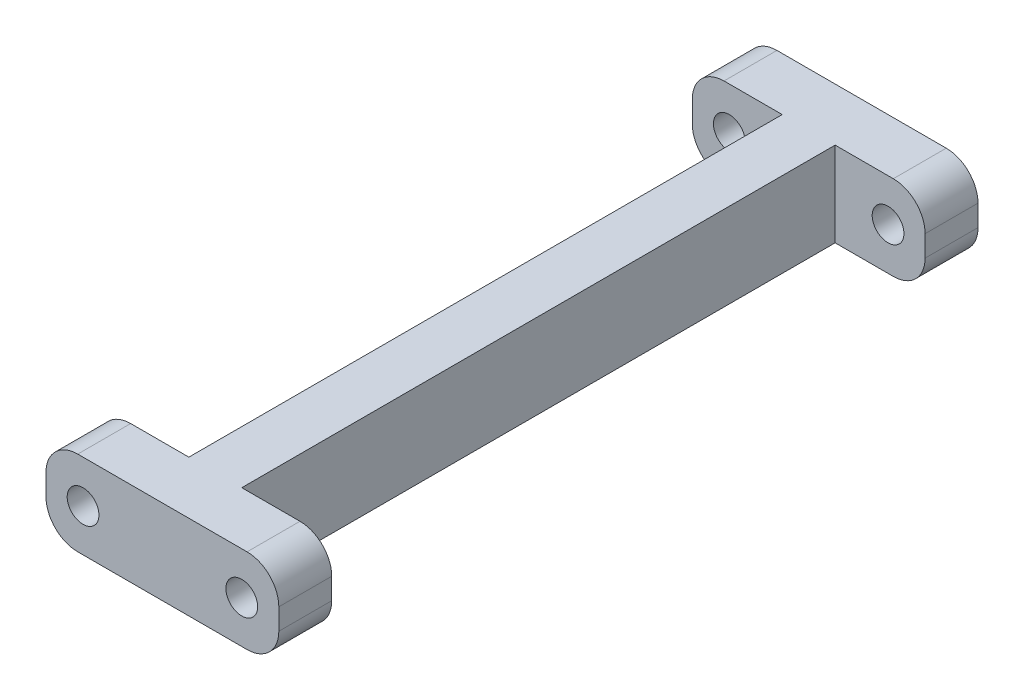
ISO-10303-21;
HEADER;
FILE_DESCRIPTION(('STEP AP214'),'2;1');
FILE_NAME('part.step','',(''),(''),'','','');
FILE_SCHEMA(('AUTOMOTIVE_DESIGN { 1 0 10303 214 1 1 1 1 }'));
ENDSEC;
DATA;
#1=APPLICATION_CONTEXT('core data for automotive mechanical design processes');
#2=APPLICATION_PROTOCOL_DEFINITION('international standard','automotive_design',2000,#1);
#3=PRODUCT_CONTEXT('',#1,'mechanical');
#4=PRODUCT('Part','Part','',(#3));
#5=PRODUCT_RELATED_PRODUCT_CATEGORY('part','',(#4));
#6=PRODUCT_DEFINITION_FORMATION('','',#4);
#7=PRODUCT_DEFINITION_CONTEXT('part definition',#1,'design');
#8=PRODUCT_DEFINITION('design','',#6,#7);
#9=PRODUCT_DEFINITION_SHAPE('','',#8);
#10=(LENGTH_UNIT() NAMED_UNIT(*) SI_UNIT(.MILLI.,.METRE.));
#11=(NAMED_UNIT(*) PLANE_ANGLE_UNIT() SI_UNIT($,.RADIAN.));
#12=(NAMED_UNIT(*) SI_UNIT($,.STERADIAN.) SOLID_ANGLE_UNIT());
#13=UNCERTAINTY_MEASURE_WITH_UNIT(LENGTH_MEASURE(1.E-05),#10,'distance_accuracy_value','');
#14=(GEOMETRIC_REPRESENTATION_CONTEXT(3) GLOBAL_UNCERTAINTY_ASSIGNED_CONTEXT((#13)) GLOBAL_UNIT_ASSIGNED_CONTEXT((#10,
#11,#12)) REPRESENTATION_CONTEXT('',''));
#15=CARTESIAN_POINT('',(0.,0.,0.));
#16=DIRECTION('',(0.,0.,1.));
#17=DIRECTION('',(1.,0.,0.));
#18=AXIS2_PLACEMENT_3D('',#15,#16,#17);
#19=CARTESIAN_POINT('',(8.5,8.,66.0706));
#20=DIRECTION('',(1.,0.,0.));
#21=DIRECTION('',(0.,1.,0.));
#22=AXIS2_PLACEMENT_3D('',#19,#20,#21);
#23=PLANE('',#22);
#24=DIRECTION('',(0.,-1.,0.));
#25=VECTOR('',#24,1.);
#26=CARTESIAN_POINT('',(8.5,8.,61.0706));
#27=LINE('',#26,#25);
#28=CARTESIAN_POINT('',(8.5,8.,61.0706));
#29=VERTEX_POINT('',#28);
#30=CARTESIAN_POINT('',(8.5,0.,61.0706));
#31=VERTEX_POINT('',#30);
#32=EDGE_CURVE('E335',#29,#31,#27,.T.);
#33=ORIENTED_EDGE('',*,*,#32,.F.);
#34=DIRECTION('',(0.,0.,-1.));
#35=VECTOR('',#34,1.);
#36=CARTESIAN_POINT('',(8.5,8.,66.0706));
#37=LINE('',#36,#35);
#38=CARTESIAN_POINT('',(8.5,8.,5.));
#39=VERTEX_POINT('',#38);
#40=EDGE_CURVE('E200',#29,#39,#37,.T.);
#41=ORIENTED_EDGE('',*,*,#40,.T.);
#42=DIRECTION('',(0.,-1.,0.));
#43=VECTOR('',#42,1.);
#44=CARTESIAN_POINT('',(8.5,8.,5.));
#45=LINE('',#44,#43);
#46=CARTESIAN_POINT('',(8.5,0.,5.));
#47=VERTEX_POINT('',#46);
#48=EDGE_CURVE('E337',#39,#47,#45,.T.);
#49=ORIENTED_EDGE('',*,*,#48,.T.);
#50=DIRECTION('',(0.,0.,-1.));
#51=VECTOR('',#50,1.);
#52=CARTESIAN_POINT('',(8.5,0.,66.0706));
#53=LINE('',#52,#51);
#54=EDGE_CURVE('E202',#31,#47,#53,.T.);
#55=ORIENTED_EDGE('',*,*,#54,.F.);
#56=EDGE_LOOP('',(#33,#41,#49,#55));
#57=FACE_BOUND('',#56,.T.);
#58=ADVANCED_FACE('F33',(#57),#23,.F.);
#59=CARTESIAN_POINT('',(13.5,8.,66.0706));
#60=DIRECTION('',(-1.,0.,0.));
#61=DIRECTION('',(0.,0.,1.));
#62=AXIS2_PLACEMENT_3D('',#59,#60,#61);
#63=PLANE('',#62);
#64=DIRECTION('',(0.,1.,0.));
#65=VECTOR('',#64,1.);
#66=CARTESIAN_POINT('',(13.5,8.,61.0706));
#67=LINE('',#66,#65);
#68=CARTESIAN_POINT('',(13.5,0.,61.0706));
#69=VERTEX_POINT('',#68);
#70=CARTESIAN_POINT('',(13.5,8.,61.0706));
#71=VERTEX_POINT('',#70);
#72=EDGE_CURVE('E187',#69,#71,#67,.T.);
#73=ORIENTED_EDGE('',*,*,#72,.F.);
#74=DIRECTION('',(0.,0.,-1.));
#75=VECTOR('',#74,1.);
#76=CARTESIAN_POINT('',(13.5,0.,66.0706));
#77=LINE('',#76,#75);
#78=CARTESIAN_POINT('',(13.5,0.,5.));
#79=VERTEX_POINT('',#78);
#80=EDGE_CURVE('E199',#69,#79,#77,.T.);
#81=ORIENTED_EDGE('',*,*,#80,.T.);
#82=DIRECTION('',(0.,1.,0.));
#83=VECTOR('',#82,1.);
#84=CARTESIAN_POINT('',(13.5,8.,5.));
#85=LINE('',#84,#83);
#86=CARTESIAN_POINT('',(13.5,8.,5.));
#87=VERTEX_POINT('',#86);
#88=EDGE_CURVE('E198',#79,#87,#85,.T.);
#89=ORIENTED_EDGE('',*,*,#88,.T.);
#90=DIRECTION('',(0.,0.,-1.));
#91=VECTOR('',#90,1.);
#92=CARTESIAN_POINT('',(13.5,8.,66.0706));
#93=LINE('',#92,#91);
#94=EDGE_CURVE('E176',#71,#87,#93,.T.);
#95=ORIENTED_EDGE('',*,*,#94,.F.);
#96=EDGE_LOOP('',(#73,#81,#89,#95));
#97=FACE_BOUND('',#96,.T.);
#98=ADVANCED_FACE('F196',(#97),#63,.F.);
#99=CARTESIAN_POINT('',(0.,0.,5.));
#100=DIRECTION('',(0.,0.,-1.));
#101=DIRECTION('',(-1.,0.,0.));
#102=AXIS2_PLACEMENT_3D('',#99,#100,#101);
#103=PLANE('',#102);
#104=CARTESIAN_POINT('',(3.5,4.,5.));
#105=DIRECTION('',(0.,0.,1.));
#106=DIRECTION('',(1.,0.,0.));
#107=AXIS2_PLACEMENT_3D('',#104,#105,#106);
#108=CIRCLE('',#107,1.5);
#109=CARTESIAN_POINT('',(5.,4.,5.));
#110=VERTEX_POINT('',#109);
#111=EDGE_CURVE('E217',#110,#110,#108,.T.);
#112=ORIENTED_EDGE('',*,*,#111,.F.);
#113=EDGE_LOOP('',(#112));
#114=FACE_BOUND('',#113,.T.);
#115=DIRECTION('',(0.,-1.,0.));
#116=VECTOR('',#115,1.);
#117=CARTESIAN_POINT('',(0.,0.,5.));
#118=LINE('',#117,#116);
#119=CARTESIAN_POINT('',(0.,5.,5.));
#120=VERTEX_POINT('',#119);
#121=CARTESIAN_POINT('',(0.,3.,5.));
#122=VERTEX_POINT('',#121);
#123=EDGE_CURVE('E223',#120,#122,#118,.T.);
#124=ORIENTED_EDGE('',*,*,#123,.T.);
#125=CARTESIAN_POINT('',(3.,3.,5.));
#126=DIRECTION('',(0.,0.,-1.));
#127=DIRECTION('',(-1.,0.,0.));
#128=AXIS2_PLACEMENT_3D('',#125,#126,#127);
#129=CIRCLE('',#128,3.);
#130=CARTESIAN_POINT('',(3.,0.,5.));
#131=VERTEX_POINT('',#130);
#132=EDGE_CURVE('E268',#122,#131,#129,.F.);
#133=ORIENTED_EDGE('',*,*,#132,.T.);
#134=DIRECTION('',(1.,0.,0.));
#135=VECTOR('',#134,1.);
#136=CARTESIAN_POINT('',(0.,0.,5.));
#137=LINE('',#136,#135);
#138=EDGE_CURVE('E228',#131,#47,#137,.T.);
#139=ORIENTED_EDGE('',*,*,#138,.T.);
#140=ORIENTED_EDGE('',*,*,#48,.F.);
#141=DIRECTION('',(-1.,0.,0.));
#142=VECTOR('',#141,1.);
#143=CARTESIAN_POINT('',(0.,8.,5.));
#144=LINE('',#143,#142);
#145=CARTESIAN_POINT('',(3.,8.,5.));
#146=VERTEX_POINT('',#145);
#147=EDGE_CURVE('E233',#39,#146,#144,.T.);
#148=ORIENTED_EDGE('',*,*,#147,.T.);
#149=CARTESIAN_POINT('',(3.,5.,5.));
#150=DIRECTION('',(0.,0.,-1.));
#151=DIRECTION('',(-1.,0.,0.));
#152=AXIS2_PLACEMENT_3D('',#149,#150,#151);
#153=CIRCLE('',#152,3.);
#154=EDGE_CURVE('E266',#146,#120,#153,.F.);
#155=ORIENTED_EDGE('',*,*,#154,.T.);
#156=EDGE_LOOP('',(#124,#133,#139,#140,#148,#155));
#157=FACE_BOUND('',#156,.T.);
#158=ADVANCED_FACE('F348',(#114,#157),#103,.F.);
#159=CARTESIAN_POINT('',(18.5,4.,5.));
#160=DIRECTION('',(0.,0.,1.));
#161=DIRECTION('',(1.,0.,0.));
#162=AXIS2_PLACEMENT_3D('',#159,#160,#161);
#163=CIRCLE('',#162,1.49999999999999);
#164=CARTESIAN_POINT('',(20.,4.,5.));
#165=VERTEX_POINT('',#164);
#166=EDGE_CURVE('E211',#165,#165,#163,.T.);
#167=ORIENTED_EDGE('',*,*,#166,.F.);
#168=EDGE_LOOP('',(#167));
#169=FACE_BOUND('',#168,.T.);
#170=CARTESIAN_POINT('',(19.,0.,5.));
#171=VERTEX_POINT('',#170);
#172=EDGE_CURVE('E226',#79,#171,#137,.T.);
#173=ORIENTED_EDGE('',*,*,#172,.T.);
#174=CARTESIAN_POINT('',(19.,3.,5.));
#175=DIRECTION('',(0.,0.,-1.));
#176=DIRECTION('',(-1.,0.,0.));
#177=AXIS2_PLACEMENT_3D('',#174,#175,#176);
#178=CIRCLE('',#177,3.);
#179=CARTESIAN_POINT('',(22.,3.,5.));
#180=VERTEX_POINT('',#179);
#181=EDGE_CURVE('E286',#171,#180,#178,.F.);
#182=ORIENTED_EDGE('',*,*,#181,.T.);
#183=DIRECTION('',(0.,1.,0.));
#184=VECTOR('',#183,1.);
#185=CARTESIAN_POINT('',(22.,0.,5.));
#186=LINE('',#185,#184);
#187=CARTESIAN_POINT('',(22.,5.,5.));
#188=VERTEX_POINT('',#187);
#189=EDGE_CURVE('E230',#180,#188,#186,.T.);
#190=ORIENTED_EDGE('',*,*,#189,.T.);
#191=CARTESIAN_POINT('',(19.,5.,5.));
#192=DIRECTION('',(0.,0.,-1.));
#193=DIRECTION('',(-1.,0.,0.));
#194=AXIS2_PLACEMENT_3D('',#191,#192,#193);
#195=CIRCLE('',#194,3.);
#196=CARTESIAN_POINT('',(19.,8.,5.));
#197=VERTEX_POINT('',#196);
#198=EDGE_CURVE('E284',#188,#197,#195,.F.);
#199=ORIENTED_EDGE('',*,*,#198,.T.);
#200=EDGE_CURVE('E194',#197,#87,#144,.T.);
#201=ORIENTED_EDGE('',*,*,#200,.T.);
#202=ORIENTED_EDGE('',*,*,#88,.F.);
#203=EDGE_LOOP('',(#173,#182,#190,#199,#201,#202));
#204=FACE_BOUND('',#203,.T.);
#205=ADVANCED_FACE('F418',(#169,#204),#103,.F.);
#206=CARTESIAN_POINT('',(0.,0.,0.));
#207=DIRECTION('',(0.,0.,-1.));
#208=DIRECTION('',(-1.,0.,0.));
#209=AXIS2_PLACEMENT_3D('',#206,#207,#208);
#210=PLANE('',#209);
#211=CARTESIAN_POINT('',(3.5,4.,0.));
#212=DIRECTION('',(0.,0.,1.));
#213=DIRECTION('',(1.,0.,0.));
#214=AXIS2_PLACEMENT_3D('',#211,#212,#213);
#215=CIRCLE('',#214,1.5);
#216=CARTESIAN_POINT('',(5.,4.,0.));
#217=VERTEX_POINT('',#216);
#218=EDGE_CURVE('E214',#217,#217,#215,.T.);
#219=ORIENTED_EDGE('',*,*,#218,.T.);
#220=EDGE_LOOP('',(#219));
#221=FACE_BOUND('',#220,.T.);
#222=DIRECTION('',(1.,0.,0.));
#223=VECTOR('',#222,1.);
#224=CARTESIAN_POINT('',(0.,0.,0.));
#225=LINE('',#224,#223);
#226=CARTESIAN_POINT('',(3.,0.,0.));
#227=VERTEX_POINT('',#226);
#228=CARTESIAN_POINT('',(19.,0.,0.));
#229=VERTEX_POINT('',#228);
#230=EDGE_CURVE('E237',#227,#229,#225,.T.);
#231=ORIENTED_EDGE('',*,*,#230,.F.);
#232=CARTESIAN_POINT('',(3.,3.,0.));
#233=DIRECTION('',(0.,0.,-1.));
#234=DIRECTION('',(-1.,0.,0.));
#235=AXIS2_PLACEMENT_3D('',#232,#233,#234);
#236=CIRCLE('',#235,3.);
#237=CARTESIAN_POINT('',(0.,3.,0.));
#238=VERTEX_POINT('',#237);
#239=EDGE_CURVE('E259',#227,#238,#236,.T.);
#240=ORIENTED_EDGE('',*,*,#239,.T.);
#241=DIRECTION('',(0.,-1.,0.));
#242=VECTOR('',#241,1.);
#243=CARTESIAN_POINT('',(0.,0.,0.));
#244=LINE('',#243,#242);
#245=CARTESIAN_POINT('',(0.,5.,0.));
#246=VERTEX_POINT('',#245);
#247=EDGE_CURVE('E220',#246,#238,#244,.T.);
#248=ORIENTED_EDGE('',*,*,#247,.F.);
#249=CARTESIAN_POINT('',(3.,5.,0.));
#250=DIRECTION('',(0.,0.,-1.));
#251=DIRECTION('',(-1.,0.,0.));
#252=AXIS2_PLACEMENT_3D('',#249,#250,#251);
#253=CIRCLE('',#252,3.);
#254=CARTESIAN_POINT('',(3.,8.,0.));
#255=VERTEX_POINT('',#254);
#256=EDGE_CURVE('E257',#246,#255,#253,.T.);
#257=ORIENTED_EDGE('',*,*,#256,.T.);
#258=DIRECTION('',(-1.,0.,0.));
#259=VECTOR('',#258,1.);
#260=CARTESIAN_POINT('',(0.,8.,0.));
#261=LINE('',#260,#259);
#262=CARTESIAN_POINT('',(19.,8.,0.));
#263=VERTEX_POINT('',#262);
#264=EDGE_CURVE('E227',#263,#255,#261,.T.);
#265=ORIENTED_EDGE('',*,*,#264,.F.);
#266=CARTESIAN_POINT('',(19.,5.,0.));
#267=DIRECTION('',(0.,0.,-1.));
#268=DIRECTION('',(-1.,0.,0.));
#269=AXIS2_PLACEMENT_3D('',#266,#267,#268);
#270=CIRCLE('',#269,3.);
#271=CARTESIAN_POINT('',(22.,5.,0.));
#272=VERTEX_POINT('',#271);
#273=EDGE_CURVE('E253',#263,#272,#270,.T.);
#274=ORIENTED_EDGE('',*,*,#273,.T.);
#275=DIRECTION('',(0.,1.,0.));
#276=VECTOR('',#275,1.);
#277=CARTESIAN_POINT('',(22.,0.,0.));
#278=LINE('',#277,#276);
#279=CARTESIAN_POINT('',(22.,3.,0.));
#280=VERTEX_POINT('',#279);
#281=EDGE_CURVE('E240',#280,#272,#278,.T.);
#282=ORIENTED_EDGE('',*,*,#281,.F.);
#283=CARTESIAN_POINT('',(19.,3.,0.));
#284=DIRECTION('',(0.,0.,-1.));
#285=DIRECTION('',(-1.,0.,0.));
#286=AXIS2_PLACEMENT_3D('',#283,#284,#285);
#287=CIRCLE('',#286,3.);
#288=EDGE_CURVE('E255',#280,#229,#287,.T.);
#289=ORIENTED_EDGE('',*,*,#288,.T.);
#290=EDGE_LOOP('',(#231,#240,#248,#257,#265,#274,#282,#289));
#291=FACE_BOUND('',#290,.T.);
#292=CARTESIAN_POINT('',(18.5,4.,0.));
#293=DIRECTION('',(0.,0.,1.));
#294=DIRECTION('',(1.,0.,0.));
#295=AXIS2_PLACEMENT_3D('',#292,#293,#294);
#296=CIRCLE('',#295,1.49999999999999);
#297=CARTESIAN_POINT('',(20.,4.,0.));
#298=VERTEX_POINT('',#297);
#299=EDGE_CURVE('E210',#298,#298,#296,.T.);
#300=ORIENTED_EDGE('',*,*,#299,.T.);
#301=EDGE_LOOP('',(#300));
#302=FACE_BOUND('',#301,.T.);
#303=ADVANCED_FACE('F420',(#221,#291,#302),#210,.T.);
#304=CARTESIAN_POINT('',(0.,0.,5.));
#305=DIRECTION('',(1.,0.,0.));
#306=DIRECTION('',(0.,0.,-1.));
#307=AXIS2_PLACEMENT_3D('',#304,#305,#306);
#308=PLANE('',#307);
#309=ORIENTED_EDGE('',*,*,#247,.T.);
#310=DIRECTION('',(0.,0.,-1.));
#311=VECTOR('',#310,1.);
#312=CARTESIAN_POINT('',(0.,3.,5.));
#313=LINE('',#312,#311);
#314=EDGE_CURVE('E264',#238,#122,#313,.F.);
#315=ORIENTED_EDGE('',*,*,#314,.T.);
#316=ORIENTED_EDGE('',*,*,#123,.F.);
#317=DIRECTION('',(0.,0.,-1.));
#318=VECTOR('',#317,1.);
#319=CARTESIAN_POINT('',(0.,5.,5.));
#320=LINE('',#319,#318);
#321=EDGE_CURVE('E261',#120,#246,#320,.T.);
#322=ORIENTED_EDGE('',*,*,#321,.T.);
#323=EDGE_LOOP('',(#309,#315,#316,#322));
#324=FACE_BOUND('',#323,.T.);
#325=ADVANCED_FACE('F359',(#324),#308,.F.);
#326=CARTESIAN_POINT('',(0.,0.,5.));
#327=DIRECTION('',(0.,1.,0.));
#328=DIRECTION('',(0.,0.,1.));
#329=AXIS2_PLACEMENT_3D('',#326,#327,#328);
#330=PLANE('',#329);
#331=ORIENTED_EDGE('',*,*,#138,.F.);
#332=DIRECTION('',(0.,0.,-1.));
#333=VECTOR('',#332,1.);
#334=CARTESIAN_POINT('',(3.,0.,5.));
#335=LINE('',#334,#333);
#336=EDGE_CURVE('E250',#131,#227,#335,.T.);
#337=ORIENTED_EDGE('',*,*,#336,.T.);
#338=ORIENTED_EDGE('',*,*,#230,.T.);
#339=DIRECTION('',(0.,0.,-1.));
#340=VECTOR('',#339,1.);
#341=CARTESIAN_POINT('',(19.,0.,5.));
#342=LINE('',#341,#340);
#343=EDGE_CURVE('E248',#229,#171,#342,.F.);
#344=ORIENTED_EDGE('',*,*,#343,.T.);
#345=ORIENTED_EDGE('',*,*,#172,.F.);
#346=ORIENTED_EDGE('',*,*,#80,.F.);
#347=DIRECTION('',(1.,0.,0.));
#348=VECTOR('',#347,1.);
#349=CARTESIAN_POINT('',(0.,0.,61.0706));
#350=LINE('',#349,#348);
#351=CARTESIAN_POINT('',(19.,0.,61.0706));
#352=VERTEX_POINT('',#351);
#353=EDGE_CURVE('E190',#69,#352,#350,.T.);
#354=ORIENTED_EDGE('',*,*,#353,.T.);
#355=DIRECTION('',(0.,0.,1.));
#356=VECTOR('',#355,1.);
#357=CARTESIAN_POINT('',(19.,0.,66.0706));
#358=LINE('',#357,#356);
#359=CARTESIAN_POINT('',(19.,0.,66.0706));
#360=VERTEX_POINT('',#359);
#361=EDGE_CURVE('E245',#352,#360,#358,.T.);
#362=ORIENTED_EDGE('',*,*,#361,.T.);
#363=DIRECTION('',(1.,0.,0.));
#364=VECTOR('',#363,1.);
#365=CARTESIAN_POINT('',(8.5,0.,66.0706));
#366=LINE('',#365,#364);
#367=CARTESIAN_POINT('',(3.,0.,66.0706));
#368=VERTEX_POINT('',#367);
#369=EDGE_CURVE('E338',#368,#360,#366,.T.);
#370=ORIENTED_EDGE('',*,*,#369,.F.);
#371=DIRECTION('',(0.,0.,1.));
#372=VECTOR('',#371,1.);
#373=CARTESIAN_POINT('',(3.,0.,61.0706));
#374=LINE('',#373,#372);
#375=CARTESIAN_POINT('',(3.,0.,61.0706));
#376=VERTEX_POINT('',#375);
#377=EDGE_CURVE('E193',#368,#376,#374,.F.);
#378=ORIENTED_EDGE('',*,*,#377,.T.);
#379=EDGE_CURVE('E329',#376,#31,#350,.T.);
#380=ORIENTED_EDGE('',*,*,#379,.T.);
#381=ORIENTED_EDGE('',*,*,#54,.T.);
#382=EDGE_LOOP('',(#331,#337,#338,#344,#345,#346,#354,#362,#370,#378,#380,#381));
#383=FACE_BOUND('',#382,.T.);
#384=ADVANCED_FACE('F366',(#383),#330,.F.);
#385=CARTESIAN_POINT('',(22.,0.,5.));
#386=DIRECTION('',(-1.,0.,0.));
#387=DIRECTION('',(0.,0.,1.));
#388=AXIS2_PLACEMENT_3D('',#385,#386,#387);
#389=PLANE('',#388);
#390=ORIENTED_EDGE('',*,*,#189,.F.);
#391=DIRECTION('',(0.,0.,-1.));
#392=VECTOR('',#391,1.);
#393=CARTESIAN_POINT('',(22.,3.,5.));
#394=LINE('',#393,#392);
#395=EDGE_CURVE('E281',#180,#280,#394,.T.);
#396=ORIENTED_EDGE('',*,*,#395,.T.);
#397=ORIENTED_EDGE('',*,*,#281,.T.);
#398=DIRECTION('',(0.,0.,-1.));
#399=VECTOR('',#398,1.);
#400=CARTESIAN_POINT('',(22.,5.,5.));
#401=LINE('',#400,#399);
#402=EDGE_CURVE('E279',#272,#188,#401,.F.);
#403=ORIENTED_EDGE('',*,*,#402,.T.);
#404=EDGE_LOOP('',(#390,#396,#397,#403));
#405=FACE_BOUND('',#404,.T.);
#406=ADVANCED_FACE('F426',(#405),#389,.F.);
#407=CARTESIAN_POINT('',(0.,8.,5.));
#408=DIRECTION('',(0.,-1.,0.));
#409=DIRECTION('',(0.,0.,-1.));
#410=AXIS2_PLACEMENT_3D('',#407,#408,#409);
#411=PLANE('',#410);
#412=ORIENTED_EDGE('',*,*,#264,.T.);
#413=DIRECTION('',(0.,0.,-1.));
#414=VECTOR('',#413,1.);
#415=CARTESIAN_POINT('',(3.,8.,5.));
#416=LINE('',#415,#414);
#417=EDGE_CURVE('E277',#255,#146,#416,.F.);
#418=ORIENTED_EDGE('',*,*,#417,.T.);
#419=ORIENTED_EDGE('',*,*,#147,.F.);
#420=ORIENTED_EDGE('',*,*,#40,.F.);
#421=DIRECTION('',(-1.,0.,0.));
#422=VECTOR('',#421,1.);
#423=CARTESIAN_POINT('',(0.,8.,61.0706));
#424=LINE('',#423,#422);
#425=CARTESIAN_POINT('',(3.,8.,61.0706));
#426=VERTEX_POINT('',#425);
#427=EDGE_CURVE('E184',#29,#426,#424,.T.);
#428=ORIENTED_EDGE('',*,*,#427,.T.);
#429=DIRECTION('',(0.,0.,1.));
#430=VECTOR('',#429,1.);
#431=CARTESIAN_POINT('',(3.,8.,66.0706));
#432=LINE('',#431,#430);
#433=CARTESIAN_POINT('',(3.,8.,66.0706));
#434=VERTEX_POINT('',#433);
#435=EDGE_CURVE('E270',#426,#434,#432,.T.);
#436=ORIENTED_EDGE('',*,*,#435,.T.);
#437=DIRECTION('',(-1.,0.,0.));
#438=VECTOR('',#437,1.);
#439=CARTESIAN_POINT('',(8.5,8.,66.0706));
#440=LINE('',#439,#438);
#441=CARTESIAN_POINT('',(19.,8.,66.0706));
#442=VERTEX_POINT('',#441);
#443=EDGE_CURVE('E204',#442,#434,#440,.T.);
#444=ORIENTED_EDGE('',*,*,#443,.F.);
#445=DIRECTION('',(0.,0.,1.));
#446=VECTOR('',#445,1.);
#447=CARTESIAN_POINT('',(19.,8.,61.0706));
#448=LINE('',#447,#446);
#449=CARTESIAN_POINT('',(19.,8.,61.0706));
#450=VERTEX_POINT('',#449);
#451=EDGE_CURVE('E180',#442,#450,#448,.F.);
#452=ORIENTED_EDGE('',*,*,#451,.T.);
#453=EDGE_CURVE('E170',#450,#71,#424,.T.);
#454=ORIENTED_EDGE('',*,*,#453,.T.);
#455=ORIENTED_EDGE('',*,*,#94,.T.);
#456=ORIENTED_EDGE('',*,*,#200,.F.);
#457=DIRECTION('',(0.,0.,-1.));
#458=VECTOR('',#457,1.);
#459=CARTESIAN_POINT('',(19.,8.,5.));
#460=LINE('',#459,#458);
#461=EDGE_CURVE('E274',#197,#263,#460,.T.);
#462=ORIENTED_EDGE('',*,*,#461,.T.);
#463=EDGE_LOOP('',(#412,#418,#419,#420,#428,#436,#444,#452,#454,#455,#456,#462));
#464=FACE_BOUND('',#463,.T.);
#465=ADVANCED_FACE('F173',(#464),#411,.F.);
#466=CARTESIAN_POINT('',(3.5,4.,5.));
#467=DIRECTION('',(0.,0.,-1.));
#468=DIRECTION('',(-1.,0.,0.));
#469=AXIS2_PLACEMENT_3D('',#466,#467,#468);
#470=CYLINDRICAL_SURFACE('',#469,1.5);
#471=ORIENTED_EDGE('',*,*,#111,.T.);
#472=EDGE_LOOP('',(#471));
#473=FACE_BOUND('',#472,.T.);
#474=ORIENTED_EDGE('',*,*,#218,.F.);
#475=EDGE_LOOP('',(#474));
#476=FACE_BOUND('',#475,.T.);
#477=ADVANCED_FACE('F411',(#473,#476),#470,.F.);
#478=CARTESIAN_POINT('',(18.5,4.,5.));
#479=DIRECTION('',(0.,0.,-1.));
#480=DIRECTION('',(-1.,0.,0.));
#481=AXIS2_PLACEMENT_3D('',#478,#479,#480);
#482=CYLINDRICAL_SURFACE('',#481,1.49999999999999);
#483=ORIENTED_EDGE('',*,*,#166,.T.);
#484=EDGE_LOOP('',(#483));
#485=FACE_BOUND('',#484,.T.);
#486=ORIENTED_EDGE('',*,*,#299,.F.);
#487=EDGE_LOOP('',(#486));
#488=FACE_BOUND('',#487,.T.);
#489=ADVANCED_FACE('F408',(#485,#488),#482,.F.);
#490=CARTESIAN_POINT('',(0.,0.,66.0706));
#491=DIRECTION('',(0.,0.,1.));
#492=DIRECTION('',(1.,0.,0.));
#493=AXIS2_PLACEMENT_3D('',#490,#491,#492);
#494=PLANE('',#493);
#495=DIRECTION('',(0.,1.,0.));
#496=VECTOR('',#495,1.);
#497=CARTESIAN_POINT('',(22.,0.,66.0706));
#498=LINE('',#497,#496);
#499=CARTESIAN_POINT('',(22.,3.,66.0706));
#500=VERTEX_POINT('',#499);
#501=CARTESIAN_POINT('',(22.,5.,66.0706));
#502=VERTEX_POINT('',#501);
#503=EDGE_CURVE('E327',#500,#502,#498,.T.);
#504=ORIENTED_EDGE('',*,*,#503,.T.);
#505=CARTESIAN_POINT('',(19.,5.,66.0706));
#506=DIRECTION('',(0.,0.,1.));
#507=DIRECTION('',(1.,0.,0.));
#508=AXIS2_PLACEMENT_3D('',#505,#506,#507);
#509=CIRCLE('',#508,3.);
#510=EDGE_CURVE('E299',#502,#442,#509,.T.);
#511=ORIENTED_EDGE('',*,*,#510,.T.);
#512=ORIENTED_EDGE('',*,*,#443,.T.);
#513=CARTESIAN_POINT('',(3.,5.,66.0706));
#514=DIRECTION('',(0.,0.,1.));
#515=DIRECTION('',(1.,0.,0.));
#516=AXIS2_PLACEMENT_3D('',#513,#514,#515);
#517=CIRCLE('',#516,3.);
#518=CARTESIAN_POINT('',(0.,5.,66.0706));
#519=VERTEX_POINT('',#518);
#520=EDGE_CURVE('E293',#434,#519,#517,.T.);
#521=ORIENTED_EDGE('',*,*,#520,.T.);
#522=DIRECTION('',(0.,-1.,0.));
#523=VECTOR('',#522,1.);
#524=CARTESIAN_POINT('',(0.,0.,66.0706));
#525=LINE('',#524,#523);
#526=CARTESIAN_POINT('',(0.,3.,66.0706));
#527=VERTEX_POINT('',#526);
#528=EDGE_CURVE('E324',#519,#527,#525,.T.);
#529=ORIENTED_EDGE('',*,*,#528,.T.);
#530=CARTESIAN_POINT('',(3.,3.,66.0706));
#531=DIRECTION('',(0.,0.,1.));
#532=DIRECTION('',(1.,0.,0.));
#533=AXIS2_PLACEMENT_3D('',#530,#531,#532);
#534=CIRCLE('',#533,3.);
#535=EDGE_CURVE('E295',#527,#368,#534,.T.);
#536=ORIENTED_EDGE('',*,*,#535,.T.);
#537=ORIENTED_EDGE('',*,*,#369,.T.);
#538=CARTESIAN_POINT('',(19.,3.,66.0706));
#539=DIRECTION('',(0.,0.,1.));
#540=DIRECTION('',(1.,0.,0.));
#541=AXIS2_PLACEMENT_3D('',#538,#539,#540);
#542=CIRCLE('',#541,3.);
#543=EDGE_CURVE('E297',#360,#500,#542,.T.);
#544=ORIENTED_EDGE('',*,*,#543,.T.);
#545=EDGE_LOOP('',(#504,#511,#512,#521,#529,#536,#537,#544));
#546=FACE_BOUND('',#545,.T.);
#547=CARTESIAN_POINT('',(18.5,4.,66.0706));
#548=DIRECTION('',(0.,0.,1.));
#549=DIRECTION('',(1.,0.,0.));
#550=AXIS2_PLACEMENT_3D('',#547,#548,#549);
#551=CIRCLE('',#550,1.5);
#552=CARTESIAN_POINT('',(20.,4.,66.0706));
#553=VERTEX_POINT('',#552);
#554=EDGE_CURVE('E651',#553,#553,#551,.T.);
#555=ORIENTED_EDGE('',*,*,#554,.F.);
#556=EDGE_LOOP('',(#555));
#557=FACE_BOUND('',#556,.T.);
#558=CARTESIAN_POINT('',(3.5,4.,66.0706));
#559=DIRECTION('',(0.,0.,1.));
#560=DIRECTION('',(1.,0.,0.));
#561=AXIS2_PLACEMENT_3D('',#558,#559,#560);
#562=CIRCLE('',#561,1.5);
#563=CARTESIAN_POINT('',(5.,4.,66.0706));
#564=VERTEX_POINT('',#563);
#565=EDGE_CURVE('E373',#564,#564,#562,.T.);
#566=ORIENTED_EDGE('',*,*,#565,.F.);
#567=EDGE_LOOP('',(#566));
#568=FACE_BOUND('',#567,.T.);
#569=ADVANCED_FACE('F322',(#546,#557,#568),#494,.T.);
#570=CARTESIAN_POINT('',(22.,0.,61.0706));
#571=DIRECTION('',(1.,0.,0.));
#572=DIRECTION('',(0.,0.,-1.));
#573=AXIS2_PLACEMENT_3D('',#570,#571,#572);
#574=PLANE('',#573);
#575=DIRECTION('',(0.,1.,0.));
#576=VECTOR('',#575,1.);
#577=CARTESIAN_POINT('',(22.,0.,61.0706));
#578=LINE('',#577,#576);
#579=CARTESIAN_POINT('',(22.,3.,61.0706));
#580=VERTEX_POINT('',#579);
#581=CARTESIAN_POINT('',(22.,5.,61.0706));
#582=VERTEX_POINT('',#581);
#583=EDGE_CURVE('E318',#580,#582,#578,.T.);
#584=ORIENTED_EDGE('',*,*,#583,.T.);
#585=DIRECTION('',(0.,0.,1.));
#586=VECTOR('',#585,1.);
#587=CARTESIAN_POINT('',(22.,5.,66.0706));
#588=LINE('',#587,#586);
#589=EDGE_CURVE('E290',#582,#502,#588,.T.);
#590=ORIENTED_EDGE('',*,*,#589,.T.);
#591=ORIENTED_EDGE('',*,*,#503,.F.);
#592=DIRECTION('',(0.,0.,1.));
#593=VECTOR('',#592,1.);
#594=CARTESIAN_POINT('',(22.,3.,61.0706));
#595=LINE('',#594,#593);
#596=EDGE_CURVE('E288',#500,#580,#595,.F.);
#597=ORIENTED_EDGE('',*,*,#596,.T.);
#598=EDGE_LOOP('',(#584,#590,#591,#597));
#599=FACE_BOUND('',#598,.T.);
#600=ADVANCED_FACE('F384',(#599),#574,.T.);
#601=CARTESIAN_POINT('',(18.5,4.,61.0706));
#602=DIRECTION('',(0.,0.,1.));
#603=DIRECTION('',(1.,0.,0.));
#604=AXIS2_PLACEMENT_3D('',#601,#602,#603);
#605=CYLINDRICAL_SURFACE('',#604,1.5);
#606=CARTESIAN_POINT('',(18.5,4.,61.0706));
#607=DIRECTION('',(0.,0.,1.));
#608=DIRECTION('',(1.,0.,0.));
#609=AXIS2_PLACEMENT_3D('',#606,#607,#608);
#610=CIRCLE('',#609,1.5);
#611=CARTESIAN_POINT('',(20.,4.,61.0706));
#612=VERTEX_POINT('',#611);
#613=EDGE_CURVE('E648',#612,#612,#610,.T.);
#614=ORIENTED_EDGE('',*,*,#613,.F.);
#615=EDGE_LOOP('',(#614));
#616=FACE_BOUND('',#615,.T.);
#617=ORIENTED_EDGE('',*,*,#554,.T.);
#618=EDGE_LOOP('',(#617));
#619=FACE_BOUND('',#618,.T.);
#620=ADVANCED_FACE('F497',(#616,#619),#605,.F.);
#621=CARTESIAN_POINT('',(0.,0.,61.0706));
#622=DIRECTION('',(0.,0.,1.));
#623=DIRECTION('',(1.,0.,0.));
#624=AXIS2_PLACEMENT_3D('',#621,#622,#623);
#625=PLANE('',#624);
#626=ORIENTED_EDGE('',*,*,#613,.T.);
#627=EDGE_LOOP('',(#626));
#628=FACE_BOUND('',#627,.T.);
#629=ORIENTED_EDGE('',*,*,#453,.F.);
#630=CARTESIAN_POINT('',(19.,5.,61.0706));
#631=DIRECTION('',(0.,0.,1.));
#632=DIRECTION('',(1.,0.,0.));
#633=AXIS2_PLACEMENT_3D('',#630,#631,#632);
#634=CIRCLE('',#633,3.);
#635=EDGE_CURVE('E303',#450,#582,#634,.F.);
#636=ORIENTED_EDGE('',*,*,#635,.T.);
#637=ORIENTED_EDGE('',*,*,#583,.F.);
#638=CARTESIAN_POINT('',(19.,3.,61.0706));
#639=DIRECTION('',(0.,0.,1.));
#640=DIRECTION('',(1.,0.,0.));
#641=AXIS2_PLACEMENT_3D('',#638,#639,#640);
#642=CIRCLE('',#641,3.);
#643=EDGE_CURVE('E301',#580,#352,#642,.F.);
#644=ORIENTED_EDGE('',*,*,#643,.T.);
#645=ORIENTED_EDGE('',*,*,#353,.F.);
#646=ORIENTED_EDGE('',*,*,#72,.T.);
#647=EDGE_LOOP('',(#629,#636,#637,#644,#645,#646));
#648=FACE_BOUND('',#647,.T.);
#649=ADVANCED_FACE('F188',(#628,#648),#625,.F.);
#650=CARTESIAN_POINT('',(3.5,4.,61.0706));
#651=DIRECTION('',(0.,0.,1.));
#652=DIRECTION('',(1.,0.,0.));
#653=AXIS2_PLACEMENT_3D('',#650,#651,#652);
#654=CIRCLE('',#653,1.5);
#655=CARTESIAN_POINT('',(5.,4.,61.0706));
#656=VERTEX_POINT('',#655);
#657=EDGE_CURVE('E331',#656,#656,#654,.T.);
#658=ORIENTED_EDGE('',*,*,#657,.T.);
#659=EDGE_LOOP('',(#658));
#660=FACE_BOUND('',#659,.T.);
#661=ORIENTED_EDGE('',*,*,#379,.F.);
#662=CARTESIAN_POINT('',(3.,3.,61.0706));
#663=DIRECTION('',(0.,0.,1.));
#664=DIRECTION('',(1.,0.,0.));
#665=AXIS2_PLACEMENT_3D('',#662,#663,#664);
#666=CIRCLE('',#665,3.);
#667=CARTESIAN_POINT('',(0.,3.,61.0706));
#668=VERTEX_POINT('',#667);
#669=EDGE_CURVE('E11',#376,#668,#666,.F.);
#670=ORIENTED_EDGE('',*,*,#669,.T.);
#671=DIRECTION('',(0.,-1.,0.));
#672=VECTOR('',#671,1.);
#673=CARTESIAN_POINT('',(0.,0.,61.0706));
#674=LINE('',#673,#672);
#675=CARTESIAN_POINT('',(0.,5.,61.0706));
#676=VERTEX_POINT('',#675);
#677=EDGE_CURVE('E183',#676,#668,#674,.T.);
#678=ORIENTED_EDGE('',*,*,#677,.F.);
#679=CARTESIAN_POINT('',(3.,5.,61.0706));
#680=DIRECTION('',(0.,0.,1.));
#681=DIRECTION('',(1.,0.,0.));
#682=AXIS2_PLACEMENT_3D('',#679,#680,#681);
#683=CIRCLE('',#682,3.);
#684=EDGE_CURVE('E41',#676,#426,#683,.F.);
#685=ORIENTED_EDGE('',*,*,#684,.T.);
#686=ORIENTED_EDGE('',*,*,#427,.F.);
#687=ORIENTED_EDGE('',*,*,#32,.T.);
#688=EDGE_LOOP('',(#661,#670,#678,#685,#686,#687));
#689=FACE_BOUND('',#688,.T.);
#690=ADVANCED_FACE('F310',(#660,#689),#625,.F.);
#691=CARTESIAN_POINT('',(0.,0.,61.0706));
#692=DIRECTION('',(-1.,0.,0.));
#693=DIRECTION('',(0.,0.,1.));
#694=AXIS2_PLACEMENT_3D('',#691,#692,#693);
#695=PLANE('',#694);
#696=ORIENTED_EDGE('',*,*,#677,.T.);
#697=DIRECTION('',(0.,0.,1.));
#698=VECTOR('',#697,1.);
#699=CARTESIAN_POINT('',(0.,3.,66.0706));
#700=LINE('',#699,#698);
#701=EDGE_CURVE('E306',#668,#527,#700,.T.);
#702=ORIENTED_EDGE('',*,*,#701,.T.);
#703=ORIENTED_EDGE('',*,*,#528,.F.);
#704=DIRECTION('',(0.,0.,1.));
#705=VECTOR('',#704,1.);
#706=CARTESIAN_POINT('',(0.,5.,61.0706));
#707=LINE('',#706,#705);
#708=EDGE_CURVE('E53',#519,#676,#707,.F.);
#709=ORIENTED_EDGE('',*,*,#708,.T.);
#710=EDGE_LOOP('',(#696,#702,#703,#709));
#711=FACE_BOUND('',#710,.T.);
#712=ADVANCED_FACE('F325',(#711),#695,.T.);
#713=CARTESIAN_POINT('',(3.5,4.,61.0706));
#714=DIRECTION('',(0.,0.,1.));
#715=DIRECTION('',(1.,0.,0.));
#716=AXIS2_PLACEMENT_3D('',#713,#714,#715);
#717=CYLINDRICAL_SURFACE('',#716,1.5);
#718=ORIENTED_EDGE('',*,*,#657,.F.);
#719=EDGE_LOOP('',(#718));
#720=FACE_BOUND('',#719,.T.);
#721=ORIENTED_EDGE('',*,*,#565,.T.);
#722=EDGE_LOOP('',(#721));
#723=FACE_BOUND('',#722,.T.);
#724=ADVANCED_FACE('F436',(#720,#723),#717,.F.);
#725=CARTESIAN_POINT('',(3.,3.,5.));
#726=DIRECTION('',(0.,0.,-1.));
#727=DIRECTION('',(-1.,0.,0.));
#728=AXIS2_PLACEMENT_3D('',#725,#726,#727);
#729=CYLINDRICAL_SURFACE('',#728,3.);
#730=ORIENTED_EDGE('',*,*,#132,.F.);
#731=ORIENTED_EDGE('',*,*,#314,.F.);
#732=ORIENTED_EDGE('',*,*,#239,.F.);
#733=ORIENTED_EDGE('',*,*,#336,.F.);
#734=EDGE_LOOP('',(#730,#731,#732,#733));
#735=FACE_BOUND('',#734,.T.);
#736=ADVANCED_FACE('F363',(#735),#729,.T.);
#737=CARTESIAN_POINT('',(3.,5.,5.));
#738=DIRECTION('',(0.,0.,-1.));
#739=DIRECTION('',(-1.,0.,0.));
#740=AXIS2_PLACEMENT_3D('',#737,#738,#739);
#741=CYLINDRICAL_SURFACE('',#740,3.);
#742=ORIENTED_EDGE('',*,*,#154,.F.);
#743=ORIENTED_EDGE('',*,*,#417,.F.);
#744=ORIENTED_EDGE('',*,*,#256,.F.);
#745=ORIENTED_EDGE('',*,*,#321,.F.);
#746=EDGE_LOOP('',(#742,#743,#744,#745));
#747=FACE_BOUND('',#746,.T.);
#748=ADVANCED_FACE('F354',(#747),#741,.T.);
#749=CARTESIAN_POINT('',(19.,3.,5.));
#750=DIRECTION('',(0.,0.,-1.));
#751=DIRECTION('',(-1.,0.,0.));
#752=AXIS2_PLACEMENT_3D('',#749,#750,#751);
#753=CYLINDRICAL_SURFACE('',#752,3.);
#754=ORIENTED_EDGE('',*,*,#181,.F.);
#755=ORIENTED_EDGE('',*,*,#343,.F.);
#756=ORIENTED_EDGE('',*,*,#288,.F.);
#757=ORIENTED_EDGE('',*,*,#395,.F.);
#758=EDGE_LOOP('',(#754,#755,#756,#757));
#759=FACE_BOUND('',#758,.T.);
#760=ADVANCED_FACE('F397',(#759),#753,.T.);
#761=CARTESIAN_POINT('',(19.,5.,5.));
#762=DIRECTION('',(0.,0.,-1.));
#763=DIRECTION('',(-1.,0.,0.));
#764=AXIS2_PLACEMENT_3D('',#761,#762,#763);
#765=CYLINDRICAL_SURFACE('',#764,3.);
#766=ORIENTED_EDGE('',*,*,#198,.F.);
#767=ORIENTED_EDGE('',*,*,#402,.F.);
#768=ORIENTED_EDGE('',*,*,#273,.F.);
#769=ORIENTED_EDGE('',*,*,#461,.F.);
#770=EDGE_LOOP('',(#766,#767,#768,#769));
#771=FACE_BOUND('',#770,.T.);
#772=ADVANCED_FACE('F390',(#771),#765,.T.);
#773=CARTESIAN_POINT('',(19.,5.,61.0706));
#774=DIRECTION('',(0.,0.,-1.));
#775=DIRECTION('',(-1.,0.,0.));
#776=AXIS2_PLACEMENT_3D('',#773,#774,#775);
#777=CYLINDRICAL_SURFACE('',#776,3.);
#778=ORIENTED_EDGE('',*,*,#635,.F.);
#779=ORIENTED_EDGE('',*,*,#451,.F.);
#780=ORIENTED_EDGE('',*,*,#510,.F.);
#781=ORIENTED_EDGE('',*,*,#589,.F.);
#782=EDGE_LOOP('',(#778,#779,#780,#781));
#783=FACE_BOUND('',#782,.T.);
#784=ADVANCED_FACE('F388',(#783),#777,.T.);
#785=CARTESIAN_POINT('',(19.,3.,5.));
#786=DIRECTION('',(0.,0.,-1.));
#787=DIRECTION('',(-1.,0.,0.));
#788=AXIS2_PLACEMENT_3D('',#785,#786,#787);
#789=CYLINDRICAL_SURFACE('',#788,3.);
#790=ORIENTED_EDGE('',*,*,#643,.F.);
#791=ORIENTED_EDGE('',*,*,#596,.F.);
#792=ORIENTED_EDGE('',*,*,#543,.F.);
#793=ORIENTED_EDGE('',*,*,#361,.F.);
#794=EDGE_LOOP('',(#790,#791,#792,#793));
#795=FACE_BOUND('',#794,.T.);
#796=ADVANCED_FACE('F380',(#795),#789,.T.);
#797=CARTESIAN_POINT('',(3.,3.,61.0706));
#798=DIRECTION('',(0.,0.,-1.));
#799=DIRECTION('',(-1.,0.,0.));
#800=AXIS2_PLACEMENT_3D('',#797,#798,#799);
#801=CYLINDRICAL_SURFACE('',#800,3.);
#802=ORIENTED_EDGE('',*,*,#669,.F.);
#803=ORIENTED_EDGE('',*,*,#377,.F.);
#804=ORIENTED_EDGE('',*,*,#535,.F.);
#805=ORIENTED_EDGE('',*,*,#701,.F.);
#806=EDGE_LOOP('',(#802,#803,#804,#805));
#807=FACE_BOUND('',#806,.T.);
#808=ADVANCED_FACE('F376',(#807),#801,.T.);
#809=CARTESIAN_POINT('',(3.,5.,5.));
#810=DIRECTION('',(0.,0.,-1.));
#811=DIRECTION('',(-1.,0.,0.));
#812=AXIS2_PLACEMENT_3D('',#809,#810,#811);
#813=CYLINDRICAL_SURFACE('',#812,3.);
#814=ORIENTED_EDGE('',*,*,#684,.F.);
#815=ORIENTED_EDGE('',*,*,#708,.F.);
#816=ORIENTED_EDGE('',*,*,#520,.F.);
#817=ORIENTED_EDGE('',*,*,#435,.F.);
#818=EDGE_LOOP('',(#814,#815,#816,#817));
#819=FACE_BOUND('',#818,.T.);
#820=ADVANCED_FACE('F35',(#819),#813,.T.);
#821=CLOSED_SHELL('',(#58,#98,#158,#205,#303,#325,#384,#406,#465,#477,#489,#569,#600,#620,#649,
#690,#712,#724,#736,#748,#760,#772,#784,#796,#808,#820));
#822=MANIFOLD_SOLID_BREP('B2',#821);
#823=ADVANCED_BREP_SHAPE_REPRESENTATION('',(#18,#822),#14);
#824=SHAPE_DEFINITION_REPRESENTATION(#9,#823);
ENDSEC;
END-ISO-10303-21;
